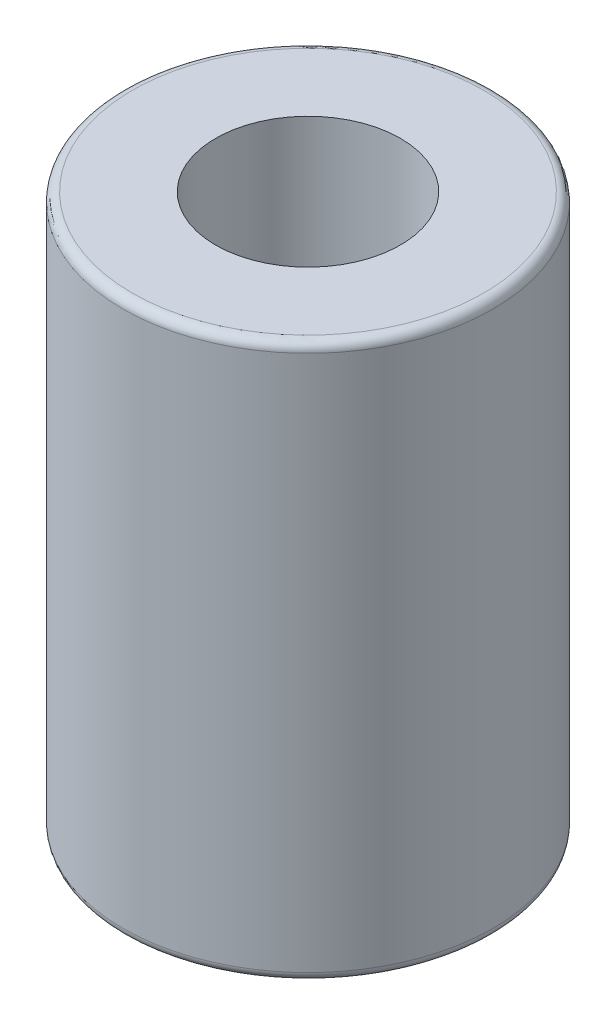
ISO-10303-21;
HEADER;
FILE_DESCRIPTION(('STEP AP214'),'2;1');
FILE_NAME('part.step','',(''),(''),'','','');
FILE_SCHEMA(('AUTOMOTIVE_DESIGN { 1 0 10303 214 1 1 1 1 }'));
ENDSEC;
DATA;
#1=APPLICATION_CONTEXT('core data for automotive mechanical design processes');
#2=APPLICATION_PROTOCOL_DEFINITION('international standard','automotive_design',2000,#1);
#3=PRODUCT_CONTEXT('',#1,'mechanical');
#4=PRODUCT('Part','Part','',(#3));
#5=PRODUCT_RELATED_PRODUCT_CATEGORY('part','',(#4));
#6=PRODUCT_DEFINITION_FORMATION('','',#4);
#7=PRODUCT_DEFINITION_CONTEXT('part definition',#1,'design');
#8=PRODUCT_DEFINITION('design','',#6,#7);
#9=PRODUCT_DEFINITION_SHAPE('','',#8);
#10=(LENGTH_UNIT() NAMED_UNIT(*) SI_UNIT(.MILLI.,.METRE.));
#11=(NAMED_UNIT(*) PLANE_ANGLE_UNIT() SI_UNIT($,.RADIAN.));
#12=(NAMED_UNIT(*) SI_UNIT($,.STERADIAN.) SOLID_ANGLE_UNIT());
#13=UNCERTAINTY_MEASURE_WITH_UNIT(LENGTH_MEASURE(1.E-05),#10,'distance_accuracy_value','');
#14=(GEOMETRIC_REPRESENTATION_CONTEXT(3) GLOBAL_UNCERTAINTY_ASSIGNED_CONTEXT((#13)) GLOBAL_UNIT_ASSIGNED_CONTEXT((#10,
#11,#12)) REPRESENTATION_CONTEXT('',''));
#15=CARTESIAN_POINT('',(0.,0.,0.));
#16=DIRECTION('',(0.,0.,1.));
#17=DIRECTION('',(1.,0.,0.));
#18=AXIS2_PLACEMENT_3D('',#15,#16,#17);
#19=CARTESIAN_POINT('',(0.,15.,0.));
#20=DIRECTION('',(0.,-1.,0.));
#21=DIRECTION('',(0.,0.,-1.));
#22=AXIS2_PLACEMENT_3D('',#19,#20,#21);
#23=CYLINDRICAL_SURFACE('',#22,5.);
#24=CARTESIAN_POINT('',(0.,0.25,0.));
#25=DIRECTION('',(0.,1.,0.));
#26=DIRECTION('',(0.,0.,1.));
#27=AXIS2_PLACEMENT_3D('',#24,#25,#26);
#28=CIRCLE('',#27,5.);
#29=CARTESIAN_POINT('',(0.,0.25,5.));
#30=VERTEX_POINT('',#29);
#31=EDGE_CURVE('E54',#30,#30,#28,.T.);
#32=ORIENTED_EDGE('',*,*,#31,.T.);
#33=EDGE_LOOP('',(#32));
#34=FACE_BOUND('',#33,.T.);
#35=CARTESIAN_POINT('',(0.,14.75,0.));
#36=DIRECTION('',(0.,1.,0.));
#37=DIRECTION('',(0.,0.,1.));
#38=AXIS2_PLACEMENT_3D('',#35,#36,#37);
#39=CIRCLE('',#38,5.);
#40=CARTESIAN_POINT('',(0.,14.75,5.));
#41=VERTEX_POINT('',#40);
#42=EDGE_CURVE('E59',#41,#41,#39,.F.);
#43=ORIENTED_EDGE('',*,*,#42,.T.);
#44=EDGE_LOOP('',(#43));
#45=FACE_BOUND('',#44,.T.);
#46=ADVANCED_FACE('F41',(#34,#45),#23,.T.);
#47=CARTESIAN_POINT('',(0.,15.,0.));
#48=DIRECTION('',(0.,1.,0.));
#49=DIRECTION('',(0.,0.,1.));
#50=AXIS2_PLACEMENT_3D('',#47,#48,#49);
#51=PLANE('',#50);
#52=CARTESIAN_POINT('',(0.,15.,0.));
#53=DIRECTION('',(0.,1.,0.));
#54=DIRECTION('',(0.,0.,1.));
#55=AXIS2_PLACEMENT_3D('',#52,#53,#54);
#56=CIRCLE('',#55,4.75);
#57=CARTESIAN_POINT('',(0.,15.,4.75));
#58=VERTEX_POINT('',#57);
#59=EDGE_CURVE('E10',#58,#58,#56,.T.);
#60=ORIENTED_EDGE('',*,*,#59,.T.);
#61=EDGE_LOOP('',(#60));
#62=FACE_BOUND('',#61,.T.);
#63=CARTESIAN_POINT('',(0.,15.,0.));
#64=DIRECTION('',(0.,1.,0.));
#65=DIRECTION('',(0.,0.,1.));
#66=AXIS2_PLACEMENT_3D('',#63,#64,#65);
#67=CIRCLE('',#66,2.5);
#68=CARTESIAN_POINT('',(0.,15.,2.5));
#69=VERTEX_POINT('',#68);
#70=EDGE_CURVE('E66',#69,#69,#67,.T.);
#71=ORIENTED_EDGE('',*,*,#70,.F.);
#72=EDGE_LOOP('',(#71));
#73=FACE_BOUND('',#72,.T.);
#74=ADVANCED_FACE('F83',(#62,#73),#51,.T.);
#75=CARTESIAN_POINT('',(0.,0.,0.));
#76=DIRECTION('',(0.,1.,0.));
#77=DIRECTION('',(0.,0.,1.));
#78=AXIS2_PLACEMENT_3D('',#75,#76,#77);
#79=PLANE('',#78);
#80=CARTESIAN_POINT('',(0.,0.,0.));
#81=DIRECTION('',(0.,1.,0.));
#82=DIRECTION('',(0.,0.,1.));
#83=AXIS2_PLACEMENT_3D('',#80,#81,#82);
#84=CIRCLE('',#83,4.75);
#85=CARTESIAN_POINT('',(0.,0.,4.75));
#86=VERTEX_POINT('',#85);
#87=EDGE_CURVE('E49',#86,#86,#84,.F.);
#88=ORIENTED_EDGE('',*,*,#87,.T.);
#89=EDGE_LOOP('',(#88));
#90=FACE_BOUND('',#89,.T.);
#91=CARTESIAN_POINT('',(0.,0.,0.));
#92=DIRECTION('',(0.,1.,0.));
#93=DIRECTION('',(0.,0.,1.));
#94=AXIS2_PLACEMENT_3D('',#91,#92,#93);
#95=CIRCLE('',#94,2.5);
#96=CARTESIAN_POINT('',(0.,0.,2.5));
#97=VERTEX_POINT('',#96);
#98=EDGE_CURVE('E65',#97,#97,#95,.T.);
#99=ORIENTED_EDGE('',*,*,#98,.T.);
#100=EDGE_LOOP('',(#99));
#101=FACE_BOUND('',#100,.T.);
#102=ADVANCED_FACE('F74',(#90,#101),#79,.F.);
#103=CARTESIAN_POINT('',(0.,0.,0.));
#104=DIRECTION('',(0.,1.,0.));
#105=DIRECTION('',(0.,0.,1.));
#106=AXIS2_PLACEMENT_3D('',#103,#104,#105);
#107=CYLINDRICAL_SURFACE('',#106,2.5);
#108=ORIENTED_EDGE('',*,*,#98,.F.);
#109=EDGE_LOOP('',(#108));
#110=FACE_BOUND('',#109,.T.);
#111=ORIENTED_EDGE('',*,*,#70,.T.);
#112=EDGE_LOOP('',(#111));
#113=FACE_BOUND('',#112,.T.);
#114=ADVANCED_FACE('F76',(#110,#113),#107,.F.);
#115=CARTESIAN_POINT('',(0.,0.25,0.));
#116=DIRECTION('',(0.,1.,0.));
#117=DIRECTION('',(0.,0.,1.));
#118=AXIS2_PLACEMENT_3D('',#115,#116,#117);
#119=TOROIDAL_SURFACE('',#118,4.75,0.25);
#120=ORIENTED_EDGE('',*,*,#87,.F.);
#121=EDGE_LOOP('',(#120));
#122=FACE_BOUND('',#121,.T.);
#123=ORIENTED_EDGE('',*,*,#31,.F.);
#124=EDGE_LOOP('',(#123));
#125=FACE_BOUND('',#124,.T.);
#126=ADVANCED_FACE('F79',(#122,#125),#119,.T.);
#127=CARTESIAN_POINT('',(0.,14.75,0.));
#128=DIRECTION('',(0.,1.,0.));
#129=DIRECTION('',(0.,0.,1.));
#130=AXIS2_PLACEMENT_3D('',#127,#128,#129);
#131=TOROIDAL_SURFACE('',#130,4.75,0.25);
#132=ORIENTED_EDGE('',*,*,#42,.F.);
#133=EDGE_LOOP('',(#132));
#134=FACE_BOUND('',#133,.T.);
#135=ORIENTED_EDGE('',*,*,#59,.F.);
#136=EDGE_LOOP('',(#135));
#137=FACE_BOUND('',#136,.T.);
#138=ADVANCED_FACE('F43',(#134,#137),#131,.T.);
#139=CLOSED_SHELL('',(#46,#74,#102,#114,#126,#138));
#140=MANIFOLD_SOLID_BREP('B2',#139);
#141=ADVANCED_BREP_SHAPE_REPRESENTATION('',(#18,#140),#14);
#142=SHAPE_DEFINITION_REPRESENTATION(#9,#141);
ENDSEC;
END-ISO-10303-21;
